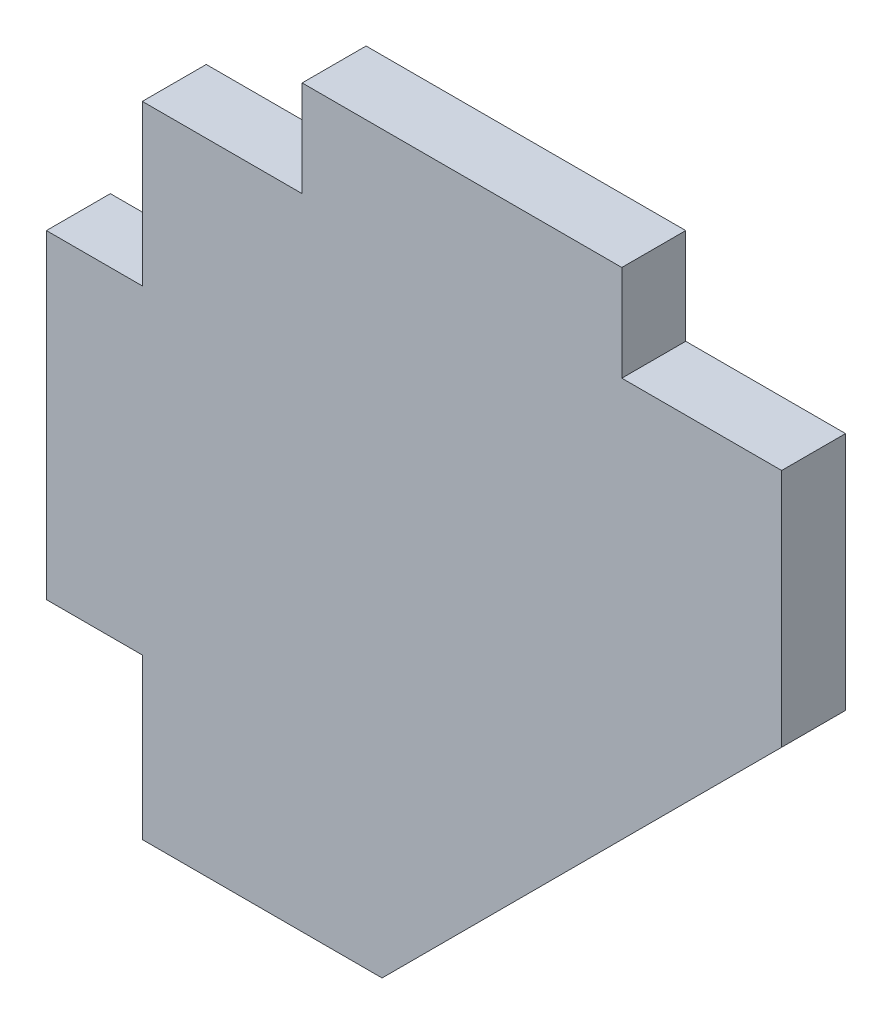
ISO-10303-21;
HEADER;
FILE_DESCRIPTION(('STEP AP214'),'2;1');
FILE_NAME('part.step','',(''),(''),'','','');
FILE_SCHEMA(('AUTOMOTIVE_DESIGN { 1 0 10303 214 1 1 1 1 }'));
ENDSEC;
DATA;
#1=APPLICATION_CONTEXT('core data for automotive mechanical design processes');
#2=APPLICATION_PROTOCOL_DEFINITION('international standard','automotive_design',2000,#1);
#3=PRODUCT_CONTEXT('',#1,'mechanical');
#4=PRODUCT('Part','Part','',(#3));
#5=PRODUCT_RELATED_PRODUCT_CATEGORY('part','',(#4));
#6=PRODUCT_DEFINITION_FORMATION('','',#4);
#7=PRODUCT_DEFINITION_CONTEXT('part definition',#1,'design');
#8=PRODUCT_DEFINITION('design','',#6,#7);
#9=PRODUCT_DEFINITION_SHAPE('','',#8);
#10=(LENGTH_UNIT() NAMED_UNIT(*) SI_UNIT(.MILLI.,.METRE.));
#11=(NAMED_UNIT(*) PLANE_ANGLE_UNIT() SI_UNIT($,.RADIAN.));
#12=(NAMED_UNIT(*) SI_UNIT($,.STERADIAN.) SOLID_ANGLE_UNIT());
#13=UNCERTAINTY_MEASURE_WITH_UNIT(LENGTH_MEASURE(1.E-05),#10,'distance_accuracy_value','');
#14=(GEOMETRIC_REPRESENTATION_CONTEXT(3) GLOBAL_UNCERTAINTY_ASSIGNED_CONTEXT((#13)) GLOBAL_UNIT_ASSIGNED_CONTEXT((#10,
#11,#12)) REPRESENTATION_CONTEXT('',''));
#15=CARTESIAN_POINT('',(0.,0.,0.));
#16=DIRECTION('',(0.,0.,1.));
#17=DIRECTION('',(1.,0.,0.));
#18=AXIS2_PLACEMENT_3D('',#15,#16,#17);
#19=CARTESIAN_POINT('',(-2459.72380541407,-14.,-4.));
#20=DIRECTION('',(-1.,0.,0.));
#21=DIRECTION('',(0.,0.,1.));
#22=AXIS2_PLACEMENT_3D('',#19,#20,#21);
#23=PLANE('',#22);
#24=DIRECTION('',(0.,-1.,0.));
#25=VECTOR('',#24,1.);
#26=CARTESIAN_POINT('',(-2459.72380541407,-14.,0.));
#27=LINE('',#26,#25);
#28=CARTESIAN_POINT('',(-2459.72380541407,-14.,0.));
#29=VERTEX_POINT('',#28);
#30=CARTESIAN_POINT('',(-2459.72380541407,-34.,0.));
#31=VERTEX_POINT('',#30);
#32=EDGE_CURVE('E160',#29,#31,#27,.T.);
#33=ORIENTED_EDGE('',*,*,#32,.F.);
#34=DIRECTION('',(0.,0.,1.));
#35=VECTOR('',#34,1.);
#36=CARTESIAN_POINT('',(-2459.72380541407,-14.,-4.));
#37=LINE('',#36,#35);
#38=CARTESIAN_POINT('',(-2459.72380541407,-14.,-4.));
#39=VERTEX_POINT('',#38);
#40=EDGE_CURVE('E11',#39,#29,#37,.T.);
#41=ORIENTED_EDGE('',*,*,#40,.F.);
#42=DIRECTION('',(0.,-1.,0.));
#43=VECTOR('',#42,1.);
#44=CARTESIAN_POINT('',(-2459.72380541407,-14.,-4.));
#45=LINE('',#44,#43);
#46=CARTESIAN_POINT('',(-2459.72380541407,-34.,-4.));
#47=VERTEX_POINT('',#46);
#48=EDGE_CURVE('E195',#39,#47,#45,.T.);
#49=ORIENTED_EDGE('',*,*,#48,.T.);
#50=DIRECTION('',(0.,0.,1.));
#51=VECTOR('',#50,1.);
#52=CARTESIAN_POINT('',(-2459.72380541407,-34.,-4.));
#53=LINE('',#52,#51);
#54=EDGE_CURVE('E36',#47,#31,#53,.T.);
#55=ORIENTED_EDGE('',*,*,#54,.T.);
#56=EDGE_LOOP('',(#33,#41,#49,#55));
#57=FACE_BOUND('',#56,.T.);
#58=ADVANCED_FACE('F33',(#57),#23,.T.);
#59=CARTESIAN_POINT('',(-2459.72380541407,-14.,-4.));
#60=DIRECTION('',(0.,1.,0.));
#61=DIRECTION('',(-1.,0.,0.));
#62=AXIS2_PLACEMENT_3D('',#59,#60,#61);
#63=PLANE('',#62);
#64=DIRECTION('',(-1.,0.,0.));
#65=VECTOR('',#64,1.);
#66=CARTESIAN_POINT('',(-2459.72380541407,-14.,0.));
#67=LINE('',#66,#65);
#68=CARTESIAN_POINT('',(-2453.72380541407,-14.,0.));
#69=VERTEX_POINT('',#68);
#70=EDGE_CURVE('E193',#69,#29,#67,.T.);
#71=ORIENTED_EDGE('',*,*,#70,.F.);
#72=DIRECTION('',(0.,0.,1.));
#73=VECTOR('',#72,1.);
#74=CARTESIAN_POINT('',(-2453.72380541407,-14.,-4.));
#75=LINE('',#74,#73);
#76=CARTESIAN_POINT('',(-2453.72380541407,-14.,-4.));
#77=VERTEX_POINT('',#76);
#78=EDGE_CURVE('E42',#77,#69,#75,.T.);
#79=ORIENTED_EDGE('',*,*,#78,.F.);
#80=DIRECTION('',(-1.,0.,0.));
#81=VECTOR('',#80,1.);
#82=CARTESIAN_POINT('',(-2459.72380541407,-14.,-4.));
#83=LINE('',#82,#81);
#84=EDGE_CURVE('E150',#77,#39,#83,.T.);
#85=ORIENTED_EDGE('',*,*,#84,.T.);
#86=ORIENTED_EDGE('',*,*,#40,.T.);
#87=EDGE_LOOP('',(#71,#79,#85,#86));
#88=FACE_BOUND('',#87,.T.);
#89=ADVANCED_FACE('F217',(#88),#63,.T.);
#90=CARTESIAN_POINT('',(-2453.72380541407,-4.,-4.));
#91=DIRECTION('',(-1.,0.,0.));
#92=DIRECTION('',(0.,0.,1.));
#93=AXIS2_PLACEMENT_3D('',#90,#91,#92);
#94=PLANE('',#93);
#95=DIRECTION('',(0.,-1.,0.));
#96=VECTOR('',#95,1.);
#97=CARTESIAN_POINT('',(-2453.72380541407,-4.,0.));
#98=LINE('',#97,#96);
#99=CARTESIAN_POINT('',(-2453.72380541407,-4.,0.));
#100=VERTEX_POINT('',#99);
#101=EDGE_CURVE('E137',#100,#69,#98,.T.);
#102=ORIENTED_EDGE('',*,*,#101,.F.);
#103=DIRECTION('',(0.,0.,1.));
#104=VECTOR('',#103,1.);
#105=CARTESIAN_POINT('',(-2453.72380541407,-4.,-4.));
#106=LINE('',#105,#104);
#107=CARTESIAN_POINT('',(-2453.72380541407,-4.,-4.));
#108=VERTEX_POINT('',#107);
#109=EDGE_CURVE('E132',#108,#100,#106,.T.);
#110=ORIENTED_EDGE('',*,*,#109,.F.);
#111=DIRECTION('',(0.,-1.,0.));
#112=VECTOR('',#111,1.);
#113=CARTESIAN_POINT('',(-2453.72380541407,-4.,-4.));
#114=LINE('',#113,#112);
#115=EDGE_CURVE('E135',#108,#77,#114,.T.);
#116=ORIENTED_EDGE('',*,*,#115,.T.);
#117=ORIENTED_EDGE('',*,*,#78,.T.);
#118=EDGE_LOOP('',(#102,#110,#116,#117));
#119=FACE_BOUND('',#118,.T.);
#120=ADVANCED_FACE('F134',(#119),#94,.T.);
#121=CARTESIAN_POINT('',(-2443.72380541407,-4.,-4.));
#122=DIRECTION('',(0.,1.,0.));
#123=DIRECTION('',(-1.,0.,0.));
#124=AXIS2_PLACEMENT_3D('',#121,#122,#123);
#125=PLANE('',#124);
#126=DIRECTION('',(-1.,0.,0.));
#127=VECTOR('',#126,1.);
#128=CARTESIAN_POINT('',(-2443.72380541407,-4.,0.));
#129=LINE('',#128,#127);
#130=CARTESIAN_POINT('',(-2443.72380541407,-4.,0.));
#131=VERTEX_POINT('',#130);
#132=EDGE_CURVE('E190',#131,#100,#129,.T.);
#133=ORIENTED_EDGE('',*,*,#132,.F.);
#134=DIRECTION('',(0.,0.,1.));
#135=VECTOR('',#134,1.);
#136=CARTESIAN_POINT('',(-2443.72380541407,-4.,-4.));
#137=LINE('',#136,#135);
#138=CARTESIAN_POINT('',(-2443.72380541407,-4.,-4.));
#139=VERTEX_POINT('',#138);
#140=EDGE_CURVE('E142',#139,#131,#137,.T.);
#141=ORIENTED_EDGE('',*,*,#140,.F.);
#142=DIRECTION('',(-1.,0.,0.));
#143=VECTOR('',#142,1.);
#144=CARTESIAN_POINT('',(-2443.72380541407,-4.,-4.));
#145=LINE('',#144,#143);
#146=EDGE_CURVE('E148',#139,#108,#145,.T.);
#147=ORIENTED_EDGE('',*,*,#146,.T.);
#148=ORIENTED_EDGE('',*,*,#109,.T.);
#149=EDGE_LOOP('',(#133,#141,#147,#148));
#150=FACE_BOUND('',#149,.T.);
#151=ADVANCED_FACE('F152',(#150),#125,.T.);
#152=CARTESIAN_POINT('',(-2443.72380541407,2.,-4.));
#153=DIRECTION('',(-1.,0.,0.));
#154=DIRECTION('',(0.,0.,1.));
#155=AXIS2_PLACEMENT_3D('',#152,#153,#154);
#156=PLANE('',#155);
#157=DIRECTION('',(0.,-1.,0.));
#158=VECTOR('',#157,1.);
#159=CARTESIAN_POINT('',(-2443.72380541407,2.,0.));
#160=LINE('',#159,#158);
#161=CARTESIAN_POINT('',(-2443.72380541407,2.,0.));
#162=VERTEX_POINT('',#161);
#163=EDGE_CURVE('E187',#162,#131,#160,.T.);
#164=ORIENTED_EDGE('',*,*,#163,.F.);
#165=DIRECTION('',(0.,0.,1.));
#166=VECTOR('',#165,1.);
#167=CARTESIAN_POINT('',(-2443.72380541407,2.,-4.));
#168=LINE('',#167,#166);
#169=CARTESIAN_POINT('',(-2443.72380541407,2.,-4.));
#170=VERTEX_POINT('',#169);
#171=EDGE_CURVE('E199',#170,#162,#168,.T.);
#172=ORIENTED_EDGE('',*,*,#171,.F.);
#173=DIRECTION('',(0.,-1.,0.));
#174=VECTOR('',#173,1.);
#175=CARTESIAN_POINT('',(-2443.72380541407,2.,-4.));
#176=LINE('',#175,#174);
#177=EDGE_CURVE('E153',#170,#139,#176,.T.);
#178=ORIENTED_EDGE('',*,*,#177,.T.);
#179=ORIENTED_EDGE('',*,*,#140,.T.);
#180=EDGE_LOOP('',(#164,#172,#178,#179));
#181=FACE_BOUND('',#180,.T.);
#182=ADVANCED_FACE('F230',(#181),#156,.T.);
#183=CARTESIAN_POINT('',(-2423.72380541407,2.,-4.));
#184=DIRECTION('',(0.,1.,0.));
#185=DIRECTION('',(-1.,0.,0.));
#186=AXIS2_PLACEMENT_3D('',#183,#184,#185);
#187=PLANE('',#186);
#188=DIRECTION('',(-1.,0.,0.));
#189=VECTOR('',#188,1.);
#190=CARTESIAN_POINT('',(-2423.72380541407,2.,0.));
#191=LINE('',#190,#189);
#192=CARTESIAN_POINT('',(-2423.72380541407,2.,0.));
#193=VERTEX_POINT('',#192);
#194=EDGE_CURVE('E184',#193,#162,#191,.T.);
#195=ORIENTED_EDGE('',*,*,#194,.F.);
#196=DIRECTION('',(0.,0.,1.));
#197=VECTOR('',#196,1.);
#198=CARTESIAN_POINT('',(-2423.72380541407,2.,-4.));
#199=LINE('',#198,#197);
#200=CARTESIAN_POINT('',(-2423.72380541407,2.,-4.));
#201=VERTEX_POINT('',#200);
#202=EDGE_CURVE('E201',#201,#193,#199,.T.);
#203=ORIENTED_EDGE('',*,*,#202,.F.);
#204=DIRECTION('',(-1.,0.,0.));
#205=VECTOR('',#204,1.);
#206=CARTESIAN_POINT('',(-2423.72380541407,2.,-4.));
#207=LINE('',#206,#205);
#208=EDGE_CURVE('E155',#201,#170,#207,.T.);
#209=ORIENTED_EDGE('',*,*,#208,.T.);
#210=ORIENTED_EDGE('',*,*,#171,.T.);
#211=EDGE_LOOP('',(#195,#203,#209,#210));
#212=FACE_BOUND('',#211,.T.);
#213=ADVANCED_FACE('F233',(#212),#187,.T.);
#214=CARTESIAN_POINT('',(-2423.72380541407,2.,-4.));
#215=DIRECTION('',(1.,0.,0.));
#216=DIRECTION('',(0.,0.,-1.));
#217=AXIS2_PLACEMENT_3D('',#214,#215,#216);
#218=PLANE('',#217);
#219=DIRECTION('',(0.,1.,0.));
#220=VECTOR('',#219,1.);
#221=CARTESIAN_POINT('',(-2423.72380541407,2.,0.));
#222=LINE('',#221,#220);
#223=CARTESIAN_POINT('',(-2423.72380541407,-4.,0.));
#224=VERTEX_POINT('',#223);
#225=EDGE_CURVE('E181',#224,#193,#222,.T.);
#226=ORIENTED_EDGE('',*,*,#225,.F.);
#227=DIRECTION('',(0.,0.,1.));
#228=VECTOR('',#227,1.);
#229=CARTESIAN_POINT('',(-2423.72380541407,-4.,-4.));
#230=LINE('',#229,#228);
#231=CARTESIAN_POINT('',(-2423.72380541407,-4.,-4.));
#232=VERTEX_POINT('',#231);
#233=EDGE_CURVE('E203',#232,#224,#230,.T.);
#234=ORIENTED_EDGE('',*,*,#233,.F.);
#235=DIRECTION('',(0.,1.,0.));
#236=VECTOR('',#235,1.);
#237=CARTESIAN_POINT('',(-2423.72380541407,2.,-4.));
#238=LINE('',#237,#236);
#239=EDGE_CURVE('E373',#232,#201,#238,.T.);
#240=ORIENTED_EDGE('',*,*,#239,.T.);
#241=ORIENTED_EDGE('',*,*,#202,.T.);
#242=EDGE_LOOP('',(#226,#234,#240,#241));
#243=FACE_BOUND('',#242,.T.);
#244=ADVANCED_FACE('F237',(#243),#218,.T.);
#245=CARTESIAN_POINT('',(-2413.72380541407,-3.99999999999999,-4.));
#246=DIRECTION('',(0.,1.,0.));
#247=DIRECTION('',(-1.,0.,0.));
#248=AXIS2_PLACEMENT_3D('',#245,#246,#247);
#249=PLANE('',#248);
#250=DIRECTION('',(-1.,0.,0.));
#251=VECTOR('',#250,1.);
#252=CARTESIAN_POINT('',(-2413.72380541407,-3.99999999999999,0.));
#253=LINE('',#252,#251);
#254=CARTESIAN_POINT('',(-2413.72380541407,-3.99999999999999,0.));
#255=VERTEX_POINT('',#254);
#256=EDGE_CURVE('E178',#255,#224,#253,.T.);
#257=ORIENTED_EDGE('',*,*,#256,.F.);
#258=DIRECTION('',(0.,0.,1.));
#259=VECTOR('',#258,1.);
#260=CARTESIAN_POINT('',(-2413.72380541407,-3.99999999999999,-4.));
#261=LINE('',#260,#259);
#262=CARTESIAN_POINT('',(-2413.72380541407,-3.99999999999999,-4.));
#263=VERTEX_POINT('',#262);
#264=EDGE_CURVE('E205',#263,#255,#261,.T.);
#265=ORIENTED_EDGE('',*,*,#264,.F.);
#266=DIRECTION('',(-1.,0.,0.));
#267=VECTOR('',#266,1.);
#268=CARTESIAN_POINT('',(-2413.72380541407,-3.99999999999999,-4.));
#269=LINE('',#268,#267);
#270=EDGE_CURVE('E369',#263,#232,#269,.T.);
#271=ORIENTED_EDGE('',*,*,#270,.T.);
#272=ORIENTED_EDGE('',*,*,#233,.T.);
#273=EDGE_LOOP('',(#257,#265,#271,#272));
#274=FACE_BOUND('',#273,.T.);
#275=ADVANCED_FACE('F241',(#274),#249,.T.);
#276=CARTESIAN_POINT('',(-2413.72380541407,-3.99999999999999,-4.));
#277=DIRECTION('',(1.,0.,0.));
#278=DIRECTION('',(0.,0.,-1.));
#279=AXIS2_PLACEMENT_3D('',#276,#277,#278);
#280=PLANE('',#279);
#281=DIRECTION('',(0.,1.,0.));
#282=VECTOR('',#281,1.);
#283=CARTESIAN_POINT('',(-2413.72380541407,-3.99999999999999,0.));
#284=LINE('',#283,#282);
#285=CARTESIAN_POINT('',(-2413.72380541407,-19.,0.));
#286=VERTEX_POINT('',#285);
#287=EDGE_CURVE('E175',#286,#255,#284,.T.);
#288=ORIENTED_EDGE('',*,*,#287,.F.);
#289=DIRECTION('',(0.,0.,1.));
#290=VECTOR('',#289,1.);
#291=CARTESIAN_POINT('',(-2413.72380541407,-19.,-4.));
#292=LINE('',#291,#290);
#293=CARTESIAN_POINT('',(-2413.72380541407,-19.,-4.));
#294=VERTEX_POINT('',#293);
#295=EDGE_CURVE('E207',#294,#286,#292,.T.);
#296=ORIENTED_EDGE('',*,*,#295,.F.);
#297=DIRECTION('',(0.,1.,0.));
#298=VECTOR('',#297,1.);
#299=CARTESIAN_POINT('',(-2413.72380541407,-3.99999999999999,-4.));
#300=LINE('',#299,#298);
#301=EDGE_CURVE('E380',#294,#263,#300,.T.);
#302=ORIENTED_EDGE('',*,*,#301,.T.);
#303=ORIENTED_EDGE('',*,*,#264,.T.);
#304=EDGE_LOOP('',(#288,#296,#302,#303));
#305=FACE_BOUND('',#304,.T.);
#306=ADVANCED_FACE('F245',(#305),#280,.T.);
#307=CARTESIAN_POINT('',(-2413.72380541407,-19.,-4.));
#308=DIRECTION('',(0.707106781186549,-0.707106781186546,0.));
#309=DIRECTION('',(0.707106781186546,0.707106781186549,0.));
#310=AXIS2_PLACEMENT_3D('',#307,#308,#309);
#311=PLANE('',#310);
#312=DIRECTION('',(0.707106781186546,0.707106781186549,0.));
#313=VECTOR('',#312,1.);
#314=CARTESIAN_POINT('',(-2413.72380541407,-19.,0.));
#315=LINE('',#314,#313);
#316=CARTESIAN_POINT('',(-2438.72380541407,-44.,0.));
#317=VERTEX_POINT('',#316);
#318=EDGE_CURVE('E172',#317,#286,#315,.T.);
#319=ORIENTED_EDGE('',*,*,#318,.F.);
#320=DIRECTION('',(0.,0.,1.));
#321=VECTOR('',#320,1.);
#322=CARTESIAN_POINT('',(-2438.72380541407,-44.,-4.));
#323=LINE('',#322,#321);
#324=CARTESIAN_POINT('',(-2438.72380541407,-44.,-4.));
#325=VERTEX_POINT('',#324);
#326=EDGE_CURVE('E209',#325,#317,#323,.T.);
#327=ORIENTED_EDGE('',*,*,#326,.F.);
#328=DIRECTION('',(0.707106781186546,0.707106781186549,0.));
#329=VECTOR('',#328,1.);
#330=CARTESIAN_POINT('',(-2413.72380541407,-19.,-4.));
#331=LINE('',#330,#329);
#332=EDGE_CURVE('E362',#325,#294,#331,.T.);
#333=ORIENTED_EDGE('',*,*,#332,.T.);
#334=ORIENTED_EDGE('',*,*,#295,.T.);
#335=EDGE_LOOP('',(#319,#327,#333,#334));
#336=FACE_BOUND('',#335,.T.);
#337=ADVANCED_FACE('F249',(#336),#311,.T.);
#338=CARTESIAN_POINT('',(-2438.72380541407,-44.,-4.));
#339=DIRECTION('',(0.,-1.,0.));
#340=DIRECTION('',(0.,0.,-1.));
#341=AXIS2_PLACEMENT_3D('',#338,#339,#340);
#342=PLANE('',#341);
#343=DIRECTION('',(1.,0.,0.));
#344=VECTOR('',#343,1.);
#345=CARTESIAN_POINT('',(-2438.72380541407,-44.,0.));
#346=LINE('',#345,#344);
#347=CARTESIAN_POINT('',(-2453.72380541407,-44.,0.));
#348=VERTEX_POINT('',#347);
#349=EDGE_CURVE('E169',#348,#317,#346,.T.);
#350=ORIENTED_EDGE('',*,*,#349,.F.);
#351=DIRECTION('',(0.,0.,1.));
#352=VECTOR('',#351,1.);
#353=CARTESIAN_POINT('',(-2453.72380541407,-44.,-4.));
#354=LINE('',#353,#352);
#355=CARTESIAN_POINT('',(-2453.72380541407,-44.,-4.));
#356=VERTEX_POINT('',#355);
#357=EDGE_CURVE('E211',#356,#348,#354,.T.);
#358=ORIENTED_EDGE('',*,*,#357,.F.);
#359=DIRECTION('',(1.,0.,0.));
#360=VECTOR('',#359,1.);
#361=CARTESIAN_POINT('',(-2438.72380541407,-44.,-4.));
#362=LINE('',#361,#360);
#363=EDGE_CURVE('E358',#356,#325,#362,.T.);
#364=ORIENTED_EDGE('',*,*,#363,.T.);
#365=ORIENTED_EDGE('',*,*,#326,.T.);
#366=EDGE_LOOP('',(#350,#358,#364,#365));
#367=FACE_BOUND('',#366,.T.);
#368=ADVANCED_FACE('F253',(#367),#342,.T.);
#369=CARTESIAN_POINT('',(-2453.72380541407,-34.,-4.));
#370=DIRECTION('',(-1.,0.,0.));
#371=DIRECTION('',(0.,0.,1.));
#372=AXIS2_PLACEMENT_3D('',#369,#370,#371);
#373=PLANE('',#372);
#374=DIRECTION('',(0.,-1.,0.));
#375=VECTOR('',#374,1.);
#376=CARTESIAN_POINT('',(-2453.72380541407,-34.,0.));
#377=LINE('',#376,#375);
#378=CARTESIAN_POINT('',(-2453.72380541407,-34.,0.));
#379=VERTEX_POINT('',#378);
#380=EDGE_CURVE('E166',#379,#348,#377,.T.);
#381=ORIENTED_EDGE('',*,*,#380,.F.);
#382=DIRECTION('',(0.,0.,1.));
#383=VECTOR('',#382,1.);
#384=CARTESIAN_POINT('',(-2453.72380541407,-34.,-4.));
#385=LINE('',#384,#383);
#386=CARTESIAN_POINT('',(-2453.72380541407,-34.,-4.));
#387=VERTEX_POINT('',#386);
#388=EDGE_CURVE('E212',#387,#379,#385,.T.);
#389=ORIENTED_EDGE('',*,*,#388,.F.);
#390=DIRECTION('',(0.,-1.,0.));
#391=VECTOR('',#390,1.);
#392=CARTESIAN_POINT('',(-2453.72380541407,-34.,-4.));
#393=LINE('',#392,#391);
#394=EDGE_CURVE('E384',#387,#356,#393,.T.);
#395=ORIENTED_EDGE('',*,*,#394,.T.);
#396=ORIENTED_EDGE('',*,*,#357,.T.);
#397=EDGE_LOOP('',(#381,#389,#395,#396));
#398=FACE_BOUND('',#397,.T.);
#399=ADVANCED_FACE('F257',(#398),#373,.T.);
#400=CARTESIAN_POINT('',(-2459.72380541407,-34.,-4.));
#401=DIRECTION('',(0.,-1.,0.));
#402=DIRECTION('',(0.,0.,-1.));
#403=AXIS2_PLACEMENT_3D('',#400,#401,#402);
#404=PLANE('',#403);
#405=DIRECTION('',(1.,0.,0.));
#406=VECTOR('',#405,1.);
#407=CARTESIAN_POINT('',(-2459.72380541407,-34.,0.));
#408=LINE('',#407,#406);
#409=EDGE_CURVE('E163',#31,#379,#408,.T.);
#410=ORIENTED_EDGE('',*,*,#409,.F.);
#411=ORIENTED_EDGE('',*,*,#54,.F.);
#412=DIRECTION('',(1.,0.,0.));
#413=VECTOR('',#412,1.);
#414=CARTESIAN_POINT('',(-2459.72380541407,-34.,-4.));
#415=LINE('',#414,#413);
#416=EDGE_CURVE('E386',#47,#387,#415,.T.);
#417=ORIENTED_EDGE('',*,*,#416,.T.);
#418=ORIENTED_EDGE('',*,*,#388,.T.);
#419=EDGE_LOOP('',(#410,#411,#417,#418));
#420=FACE_BOUND('',#419,.T.);
#421=ADVANCED_FACE('F214',(#420),#404,.T.);
#422=CARTESIAN_POINT('',(0.,0.,-4.));
#423=DIRECTION('',(0.,0.,1.));
#424=DIRECTION('',(1.,0.,0.));
#425=AXIS2_PLACEMENT_3D('',#422,#423,#424);
#426=PLANE('',#425);
#427=ORIENTED_EDGE('',*,*,#48,.F.);
#428=ORIENTED_EDGE('',*,*,#84,.F.);
#429=ORIENTED_EDGE('',*,*,#115,.F.);
#430=ORIENTED_EDGE('',*,*,#146,.F.);
#431=ORIENTED_EDGE('',*,*,#177,.F.);
#432=ORIENTED_EDGE('',*,*,#208,.F.);
#433=ORIENTED_EDGE('',*,*,#239,.F.);
#434=ORIENTED_EDGE('',*,*,#270,.F.);
#435=ORIENTED_EDGE('',*,*,#301,.F.);
#436=ORIENTED_EDGE('',*,*,#332,.F.);
#437=ORIENTED_EDGE('',*,*,#363,.F.);
#438=ORIENTED_EDGE('',*,*,#394,.F.);
#439=ORIENTED_EDGE('',*,*,#416,.F.);
#440=EDGE_LOOP('',(#427,#428,#429,#430,#431,#432,#433,#434,#435,#436,#437,#438,#439));
#441=FACE_BOUND('',#440,.T.);
#442=ADVANCED_FACE('F146',(#441),#426,.F.);
#443=CARTESIAN_POINT('',(0.,0.,0.));
#444=DIRECTION('',(0.,0.,1.));
#445=DIRECTION('',(1.,0.,0.));
#446=AXIS2_PLACEMENT_3D('',#443,#444,#445);
#447=PLANE('',#446);
#448=ORIENTED_EDGE('',*,*,#32,.T.);
#449=ORIENTED_EDGE('',*,*,#409,.T.);
#450=ORIENTED_EDGE('',*,*,#380,.T.);
#451=ORIENTED_EDGE('',*,*,#349,.T.);
#452=ORIENTED_EDGE('',*,*,#318,.T.);
#453=ORIENTED_EDGE('',*,*,#287,.T.);
#454=ORIENTED_EDGE('',*,*,#256,.T.);
#455=ORIENTED_EDGE('',*,*,#225,.T.);
#456=ORIENTED_EDGE('',*,*,#194,.T.);
#457=ORIENTED_EDGE('',*,*,#163,.T.);
#458=ORIENTED_EDGE('',*,*,#132,.T.);
#459=ORIENTED_EDGE('',*,*,#101,.T.);
#460=ORIENTED_EDGE('',*,*,#70,.T.);
#461=EDGE_LOOP('',(#448,#449,#450,#451,#452,#453,#454,#455,#456,#457,#458,#459,#460));
#462=FACE_BOUND('',#461,.T.);
#463=ADVANCED_FACE('F216',(#462),#447,.T.);
#464=CLOSED_SHELL('',(#58,#89,#120,#151,#182,#213,#244,#275,#306,#337,#368,#399,#421,#442,#463));
#465=MANIFOLD_SOLID_BREP('B2',#464);
#466=ADVANCED_BREP_SHAPE_REPRESENTATION('',(#18,#465),#14);
#467=SHAPE_DEFINITION_REPRESENTATION(#9,#466);
ENDSEC;
END-ISO-10303-21;
